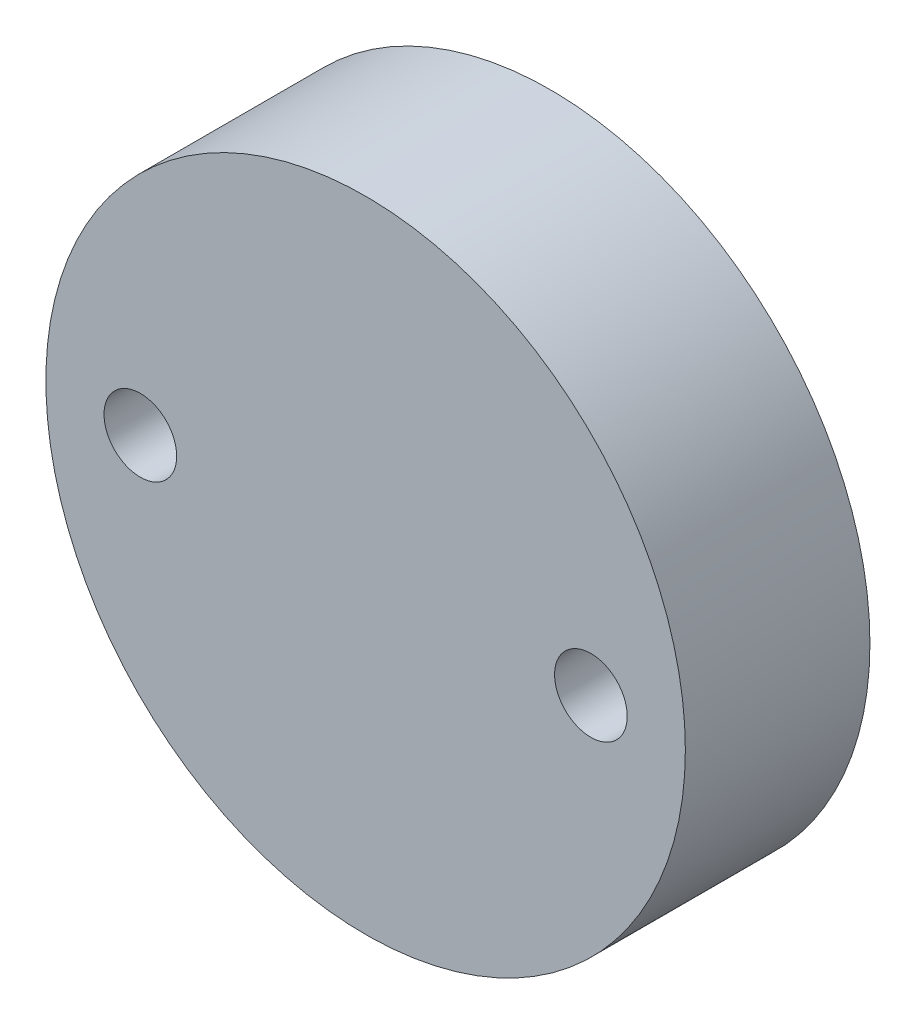
ISO-10303-21;
HEADER;
FILE_DESCRIPTION(('STEP AP214'),'2;1');
FILE_NAME('part.step','',(''),(''),'','','');
FILE_SCHEMA(('AUTOMOTIVE_DESIGN { 1 0 10303 214 1 1 1 1 }'));
ENDSEC;
DATA;
#1=APPLICATION_CONTEXT('core data for automotive mechanical design processes');
#2=APPLICATION_PROTOCOL_DEFINITION('international standard','automotive_design',2000,#1);
#3=PRODUCT_CONTEXT('',#1,'mechanical');
#4=PRODUCT('Part','Part','',(#3));
#5=PRODUCT_RELATED_PRODUCT_CATEGORY('part','',(#4));
#6=PRODUCT_DEFINITION_FORMATION('','',#4);
#7=PRODUCT_DEFINITION_CONTEXT('part definition',#1,'design');
#8=PRODUCT_DEFINITION('design','',#6,#7);
#9=PRODUCT_DEFINITION_SHAPE('','',#8);
#10=(LENGTH_UNIT() NAMED_UNIT(*) SI_UNIT(.MILLI.,.METRE.));
#11=(NAMED_UNIT(*) PLANE_ANGLE_UNIT() SI_UNIT($,.RADIAN.));
#12=(NAMED_UNIT(*) SI_UNIT($,.STERADIAN.) SOLID_ANGLE_UNIT());
#13=UNCERTAINTY_MEASURE_WITH_UNIT(LENGTH_MEASURE(1.E-05),#10,'distance_accuracy_value','');
#14=(GEOMETRIC_REPRESENTATION_CONTEXT(3) GLOBAL_UNCERTAINTY_ASSIGNED_CONTEXT((#13)) GLOBAL_UNIT_ASSIGNED_CONTEXT((#10,
#11,#12)) REPRESENTATION_CONTEXT('',''));
#15=CARTESIAN_POINT('',(0.,0.,0.));
#16=DIRECTION('',(0.,0.,1.));
#17=DIRECTION('',(1.,0.,0.));
#18=AXIS2_PLACEMENT_3D('',#15,#16,#17);
#19=CARTESIAN_POINT('',(0.,0.,6.35));
#20=DIRECTION('',(0.,0.,1.));
#21=DIRECTION('',(1.,0.,0.));
#22=AXIS2_PLACEMENT_3D('',#19,#20,#21);
#23=PLANE('',#22);
#24=CARTESIAN_POINT('',(-7.75,0.,6.35));
#25=DIRECTION('',(0.,0.,1.));
#26=DIRECTION('',(1.,0.,0.));
#27=AXIS2_PLACEMENT_3D('',#24,#25,#26);
#28=CIRCLE('',#27,1.25);
#29=CARTESIAN_POINT('',(-6.5,0.,6.35));
#30=VERTEX_POINT('',#29);
#31=EDGE_CURVE('E47',#30,#30,#28,.T.);
#32=ORIENTED_EDGE('',*,*,#31,.F.);
#33=EDGE_LOOP('',(#32));
#34=FACE_BOUND('',#33,.T.);
#35=CARTESIAN_POINT('',(0.,0.,6.35));
#36=DIRECTION('',(0.,0.,1.));
#37=DIRECTION('',(1.,0.,0.));
#38=AXIS2_PLACEMENT_3D('',#35,#36,#37);
#39=CIRCLE('',#38,11.);
#40=CARTESIAN_POINT('',(11.,0.,6.35));
#41=VERTEX_POINT('',#40);
#42=EDGE_CURVE('E11',#41,#41,#39,.T.);
#43=ORIENTED_EDGE('',*,*,#42,.T.);
#44=EDGE_LOOP('',(#43));
#45=FACE_BOUND('',#44,.T.);
#46=CARTESIAN_POINT('',(7.75,0.,6.35));
#47=DIRECTION('',(0.,0.,1.));
#48=DIRECTION('',(-1.,0.,0.));
#49=AXIS2_PLACEMENT_3D('',#46,#47,#48);
#50=CIRCLE('',#49,1.25);
#51=CARTESIAN_POINT('',(6.5,0.,6.35));
#52=VERTEX_POINT('',#51);
#53=EDGE_CURVE('E54',#52,#52,#50,.T.);
#54=ORIENTED_EDGE('',*,*,#53,.F.);
#55=EDGE_LOOP('',(#54));
#56=FACE_BOUND('',#55,.T.);
#57=ADVANCED_FACE('F34',(#34,#45,#56),#23,.T.);
#58=CARTESIAN_POINT('',(0.,0.,0.));
#59=DIRECTION('',(0.,0.,1.));
#60=DIRECTION('',(1.,0.,0.));
#61=AXIS2_PLACEMENT_3D('',#58,#59,#60);
#62=PLANE('',#61);
#63=CARTESIAN_POINT('',(-7.75,0.,0.));
#64=DIRECTION('',(0.,0.,1.));
#65=DIRECTION('',(1.,0.,0.));
#66=AXIS2_PLACEMENT_3D('',#63,#64,#65);
#67=CIRCLE('',#66,1.25);
#68=CARTESIAN_POINT('',(-6.5,0.,0.));
#69=VERTEX_POINT('',#68);
#70=EDGE_CURVE('E49',#69,#69,#67,.T.);
#71=ORIENTED_EDGE('',*,*,#70,.T.);
#72=EDGE_LOOP('',(#71));
#73=FACE_BOUND('',#72,.T.);
#74=CARTESIAN_POINT('',(0.,0.,0.));
#75=DIRECTION('',(0.,0.,1.));
#76=DIRECTION('',(1.,0.,0.));
#77=AXIS2_PLACEMENT_3D('',#74,#75,#76);
#78=CIRCLE('',#77,11.);
#79=CARTESIAN_POINT('',(11.,0.,0.));
#80=VERTEX_POINT('',#79);
#81=EDGE_CURVE('E38',#80,#80,#78,.T.);
#82=ORIENTED_EDGE('',*,*,#81,.F.);
#83=EDGE_LOOP('',(#82));
#84=FACE_BOUND('',#83,.T.);
#85=CARTESIAN_POINT('',(7.75,0.,0.));
#86=DIRECTION('',(0.,0.,1.));
#87=DIRECTION('',(-1.,0.,0.));
#88=AXIS2_PLACEMENT_3D('',#85,#86,#87);
#89=CIRCLE('',#88,1.25);
#90=CARTESIAN_POINT('',(6.5,0.,0.));
#91=VERTEX_POINT('',#90);
#92=EDGE_CURVE('E57',#91,#91,#89,.T.);
#93=ORIENTED_EDGE('',*,*,#92,.T.);
#94=EDGE_LOOP('',(#93));
#95=FACE_BOUND('',#94,.T.);
#96=ADVANCED_FACE('F69',(#73,#84,#95),#62,.F.);
#97=CARTESIAN_POINT('',(0.,0.,6.35));
#98=DIRECTION('',(0.,0.,-1.));
#99=DIRECTION('',(-1.,0.,0.));
#100=AXIS2_PLACEMENT_3D('',#97,#98,#99);
#101=CYLINDRICAL_SURFACE('',#100,11.);
#102=ORIENTED_EDGE('',*,*,#42,.F.);
#103=EDGE_LOOP('',(#102));
#104=FACE_BOUND('',#103,.T.);
#105=ORIENTED_EDGE('',*,*,#81,.T.);
#106=EDGE_LOOP('',(#105));
#107=FACE_BOUND('',#106,.T.);
#108=ADVANCED_FACE('F36',(#104,#107),#101,.T.);
#109=CARTESIAN_POINT('',(-7.75,0.,6.35));
#110=DIRECTION('',(0.,0.,-1.));
#111=DIRECTION('',(-1.,0.,0.));
#112=AXIS2_PLACEMENT_3D('',#109,#110,#111);
#113=CYLINDRICAL_SURFACE('',#112,1.25);
#114=ORIENTED_EDGE('',*,*,#31,.T.);
#115=EDGE_LOOP('',(#114));
#116=FACE_BOUND('',#115,.T.);
#117=ORIENTED_EDGE('',*,*,#70,.F.);
#118=EDGE_LOOP('',(#117));
#119=FACE_BOUND('',#118,.T.);
#120=ADVANCED_FACE('F78',(#116,#119),#113,.F.);
#121=CARTESIAN_POINT('',(7.75,0.,6.35));
#122=DIRECTION('',(0.,0.,-1.));
#123=DIRECTION('',(-1.,0.,0.));
#124=AXIS2_PLACEMENT_3D('',#121,#122,#123);
#125=CYLINDRICAL_SURFACE('',#124,1.25);
#126=ORIENTED_EDGE('',*,*,#53,.T.);
#127=EDGE_LOOP('',(#126));
#128=FACE_BOUND('',#127,.T.);
#129=ORIENTED_EDGE('',*,*,#92,.F.);
#130=EDGE_LOOP('',(#129));
#131=FACE_BOUND('',#130,.T.);
#132=ADVANCED_FACE('F65',(#128,#131),#125,.F.);
#133=CLOSED_SHELL('',(#57,#96,#108,#120,#132));
#134=MANIFOLD_SOLID_BREP('B2',#133);
#135=ADVANCED_BREP_SHAPE_REPRESENTATION('',(#18,#134),#14);
#136=SHAPE_DEFINITION_REPRESENTATION(#9,#135);
ENDSEC;
END-ISO-10303-21;
